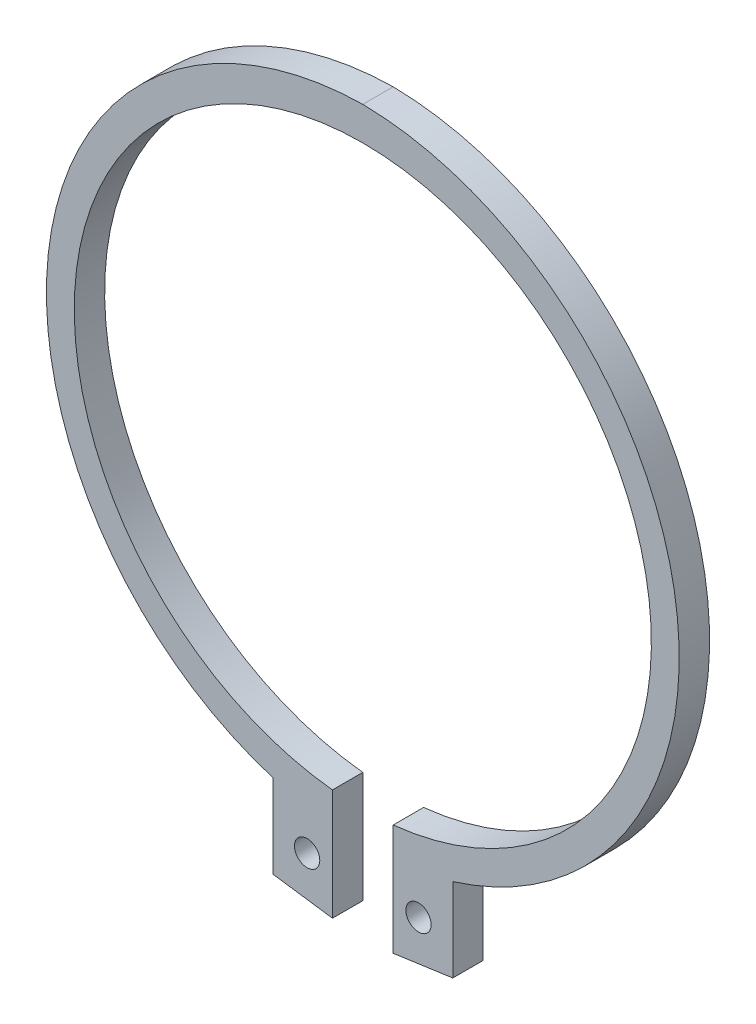
ISO-10303-21;
HEADER;
FILE_DESCRIPTION(('STEP AP214'),'2;1');
FILE_NAME('part.step','',(''),(''),'','','');
FILE_SCHEMA(('AUTOMOTIVE_DESIGN { 1 0 10303 214 1 1 1 1 }'));
ENDSEC;
DATA;
#1=APPLICATION_CONTEXT('core data for automotive mechanical design processes');
#2=APPLICATION_PROTOCOL_DEFINITION('international standard','automotive_design',2000,#1);
#3=PRODUCT_CONTEXT('',#1,'mechanical');
#4=PRODUCT('Part','Part','',(#3));
#5=PRODUCT_RELATED_PRODUCT_CATEGORY('part','',(#4));
#6=PRODUCT_DEFINITION_FORMATION('','',#4);
#7=PRODUCT_DEFINITION_CONTEXT('part definition',#1,'design');
#8=PRODUCT_DEFINITION('design','',#6,#7);
#9=PRODUCT_DEFINITION_SHAPE('','',#8);
#10=(LENGTH_UNIT() NAMED_UNIT(*) SI_UNIT(.MILLI.,.METRE.));
#11=(NAMED_UNIT(*) PLANE_ANGLE_UNIT() SI_UNIT($,.RADIAN.));
#12=(NAMED_UNIT(*) SI_UNIT($,.STERADIAN.) SOLID_ANGLE_UNIT());
#13=UNCERTAINTY_MEASURE_WITH_UNIT(LENGTH_MEASURE(1.E-05),#10,'distance_accuracy_value','');
#14=(GEOMETRIC_REPRESENTATION_CONTEXT(3) GLOBAL_UNCERTAINTY_ASSIGNED_CONTEXT((#13)) GLOBAL_UNIT_ASSIGNED_CONTEXT((#10,
#11,#12)) REPRESENTATION_CONTEXT('',''));
#15=CARTESIAN_POINT('',(0.,0.,0.));
#16=DIRECTION('',(0.,0.,1.));
#17=DIRECTION('',(1.,0.,0.));
#18=AXIS2_PLACEMENT_3D('',#15,#16,#17);
#19=CARTESIAN_POINT('',(5.5,-35.,1.5));
#20=DIRECTION('',(0.,0.,-1.));
#21=DIRECTION('',(1.,0.,0.));
#22=AXIS2_PLACEMENT_3D('',#19,#20,#21);
#23=CYLINDRICAL_SURFACE('',#22,1.25);
#24=CARTESIAN_POINT('',(5.5,-35.,0.));
#25=DIRECTION('',(0.,0.,1.));
#26=DIRECTION('',(1.,0.,0.));
#27=AXIS2_PLACEMENT_3D('',#24,#25,#26);
#28=CIRCLE('',#27,1.25);
#29=CARTESIAN_POINT('',(6.75,-35.,0.));
#30=VERTEX_POINT('',#29);
#31=EDGE_CURVE('E33',#30,#30,#28,.T.);
#32=ORIENTED_EDGE('',*,*,#31,.F.);
#33=EDGE_LOOP('',(#32));
#34=FACE_BOUND('',#33,.T.);
#35=CARTESIAN_POINT('',(5.5,-35.,3.));
#36=DIRECTION('',(0.,0.,-1.));
#37=DIRECTION('',(1.,0.,0.));
#38=AXIS2_PLACEMENT_3D('',#35,#36,#37);
#39=CIRCLE('',#38,1.25);
#40=CARTESIAN_POINT('',(6.75,-35.,3.));
#41=VERTEX_POINT('',#40);
#42=EDGE_CURVE('E131',#41,#41,#39,.T.);
#43=ORIENTED_EDGE('',*,*,#42,.F.);
#44=EDGE_LOOP('',(#43));
#45=FACE_BOUND('',#44,.T.);
#46=ADVANCED_FACE('F16',(#34,#45),#23,.F.);
#47=CARTESIAN_POINT('',(-5.5,-35.,1.5));
#48=DIRECTION('',(0.,0.,-1.));
#49=DIRECTION('',(1.,0.,0.));
#50=AXIS2_PLACEMENT_3D('',#47,#48,#49);
#51=CYLINDRICAL_SURFACE('',#50,1.25);
#52=CARTESIAN_POINT('',(-5.5,-35.,0.));
#53=DIRECTION('',(0.,0.,1.));
#54=DIRECTION('',(1.,0.,0.));
#55=AXIS2_PLACEMENT_3D('',#52,#53,#54);
#56=CIRCLE('',#55,1.25);
#57=CARTESIAN_POINT('',(-4.25,-35.,0.));
#58=VERTEX_POINT('',#57);
#59=EDGE_CURVE('E161',#58,#58,#56,.T.);
#60=ORIENTED_EDGE('',*,*,#59,.F.);
#61=EDGE_LOOP('',(#60));
#62=FACE_BOUND('',#61,.T.);
#63=CARTESIAN_POINT('',(-5.5,-35.,3.));
#64=DIRECTION('',(0.,0.,-1.));
#65=DIRECTION('',(1.,0.,0.));
#66=AXIS2_PLACEMENT_3D('',#63,#64,#65);
#67=CIRCLE('',#66,1.25);
#68=CARTESIAN_POINT('',(-4.25,-35.,3.));
#69=VERTEX_POINT('',#68);
#70=EDGE_CURVE('E137',#69,#69,#67,.T.);
#71=ORIENTED_EDGE('',*,*,#70,.F.);
#72=EDGE_LOOP('',(#71));
#73=FACE_BOUND('',#72,.T.);
#74=ADVANCED_FACE('F210',(#62,#73),#51,.F.);
#75=CARTESIAN_POINT('',(3.,-22.75,1.5));
#76=DIRECTION('',(-1.,0.,0.));
#77=DIRECTION('',(0.,0.,1.));
#78=AXIS2_PLACEMENT_3D('',#75,#76,#77);
#79=PLANE('',#78);
#80=DIRECTION('',(0.,0.,-1.));
#81=VECTOR('',#80,1.);
#82=CARTESIAN_POINT('',(3.,-39.3186793051128,2.25));
#83=LINE('',#82,#81);
#84=CARTESIAN_POINT('',(3.,-39.3186793051128,3.));
#85=VERTEX_POINT('',#84);
#86=CARTESIAN_POINT('',(3.,-39.3186793051128,0.));
#87=VERTEX_POINT('',#86);
#88=EDGE_CURVE('E11',#85,#87,#83,.T.);
#89=ORIENTED_EDGE('',*,*,#88,.F.);
#90=DIRECTION('',(0.,-1.,0.));
#91=VECTOR('',#90,1.);
#92=CARTESIAN_POINT('',(3.,-12.5343406785952,3.));
#93=LINE('',#92,#91);
#94=CARTESIAN_POINT('',(3.,-28.3416654415368,3.));
#95=VERTEX_POINT('',#94);
#96=EDGE_CURVE('E62',#95,#85,#93,.T.);
#97=ORIENTED_EDGE('',*,*,#96,.F.);
#98=DIRECTION('',(0.,0.,1.));
#99=VECTOR('',#98,1.);
#100=CARTESIAN_POINT('',(3.,-28.3416654415368,1.5));
#101=LINE('',#100,#99);
#102=CARTESIAN_POINT('',(3.,-28.3416654415368,0.));
#103=VERTEX_POINT('',#102);
#104=EDGE_CURVE('E67',#103,#95,#101,.T.);
#105=ORIENTED_EDGE('',*,*,#104,.F.);
#106=DIRECTION('',(0.,1.,0.));
#107=VECTOR('',#106,1.);
#108=CARTESIAN_POINT('',(3.,-12.5343406785952,0.));
#109=LINE('',#108,#107);
#110=EDGE_CURVE('E165',#87,#103,#109,.T.);
#111=ORIENTED_EDGE('',*,*,#110,.F.);
#112=EDGE_LOOP('',(#89,#97,#105,#111));
#113=FACE_BOUND('',#112,.T.);
#114=ADVANCED_FACE('F18',(#113),#79,.T.);
#115=CARTESIAN_POINT('',(-3.,-22.75,1.5));
#116=DIRECTION('',(1.,0.,0.));
#117=DIRECTION('',(0.,0.,-1.));
#118=AXIS2_PLACEMENT_3D('',#115,#116,#117);
#119=PLANE('',#118);
#120=DIRECTION('',(0.,0.,1.));
#121=VECTOR('',#120,1.);
#122=CARTESIAN_POINT('',(-3.,-39.3186793051128,0.75));
#123=LINE('',#122,#121);
#124=CARTESIAN_POINT('',(-3.,-39.3186793051128,0.));
#125=VERTEX_POINT('',#124);
#126=CARTESIAN_POINT('',(-3.,-39.3186793051128,3.));
#127=VERTEX_POINT('',#126);
#128=EDGE_CURVE('E150',#125,#127,#123,.T.);
#129=ORIENTED_EDGE('',*,*,#128,.F.);
#130=DIRECTION('',(0.,-1.,0.));
#131=VECTOR('',#130,1.);
#132=CARTESIAN_POINT('',(-3.,-12.5343406785952,0.));
#133=LINE('',#132,#131);
#134=CARTESIAN_POINT('',(-3.,-28.3416654415368,0.));
#135=VERTEX_POINT('',#134);
#136=EDGE_CURVE('E181',#135,#125,#133,.T.);
#137=ORIENTED_EDGE('',*,*,#136,.F.);
#138=DIRECTION('',(0.,0.,-1.));
#139=VECTOR('',#138,1.);
#140=CARTESIAN_POINT('',(-3.,-28.3416654415368,1.5));
#141=LINE('',#140,#139);
#142=CARTESIAN_POINT('',(-3.,-28.3416654415368,3.));
#143=VERTEX_POINT('',#142);
#144=EDGE_CURVE('E142',#143,#135,#141,.T.);
#145=ORIENTED_EDGE('',*,*,#144,.F.);
#146=DIRECTION('',(0.,1.,0.));
#147=VECTOR('',#146,1.);
#148=CARTESIAN_POINT('',(-3.,-12.5343406785952,3.));
#149=LINE('',#148,#147);
#150=EDGE_CURVE('E170',#127,#143,#149,.T.);
#151=ORIENTED_EDGE('',*,*,#150,.F.);
#152=EDGE_LOOP('',(#129,#137,#145,#151));
#153=FACE_BOUND('',#152,.T.);
#154=ADVANCED_FACE('F225',(#153),#119,.T.);
#155=CARTESIAN_POINT('',(5.68475265744546,-38.9395832273158,3.));
#156=DIRECTION('',(0.139816376114364,-0.990177449233342,0.));
#157=DIRECTION('',(-0.990177449233342,-0.139816376114364,0.));
#158=AXIS2_PLACEMENT_3D('',#155,#156,#157);
#159=PLANE('',#158);
#160=ORIENTED_EDGE('',*,*,#88,.T.);
#161=DIRECTION('',(0.990177449233342,0.139816376114364,0.));
#162=VECTOR('',#161,1.);
#163=CARTESIAN_POINT('',(8.88556664658266,-38.4876175590168,0.));
#164=LINE('',#163,#162);
#165=CARTESIAN_POINT('',(8.88556664658266,-38.4876175590168,0.));
#166=VERTEX_POINT('',#165);
#167=EDGE_CURVE('E26',#87,#166,#164,.T.);
#168=ORIENTED_EDGE('',*,*,#167,.T.);
#169=DIRECTION('',(0.,0.,-1.));
#170=VECTOR('',#169,1.);
#171=CARTESIAN_POINT('',(8.88556664658266,-38.4876175590168,3.));
#172=LINE('',#171,#170);
#173=CARTESIAN_POINT('',(8.88556664658266,-38.4876175590168,3.));
#174=VERTEX_POINT('',#173);
#175=EDGE_CURVE('E120',#174,#166,#172,.T.);
#176=ORIENTED_EDGE('',*,*,#175,.F.);
#177=DIRECTION('',(-0.990177449233342,-0.139816376114364,0.));
#178=VECTOR('',#177,1.);
#179=CARTESIAN_POINT('',(8.88556664658266,-38.4876175590168,3.));
#180=LINE('',#179,#178);
#181=EDGE_CURVE('E155',#174,#85,#180,.T.);
#182=ORIENTED_EDGE('',*,*,#181,.T.);
#183=EDGE_LOOP('',(#160,#168,#176,#182));
#184=FACE_BOUND('',#183,.T.);
#185=ADVANCED_FACE('F206',(#184),#159,.T.);
#186=CARTESIAN_POINT('',(-16.4490135772004,-2.31868135719037,0.));
#187=DIRECTION('',(0.,0.,1.));
#188=DIRECTION('',(1.,0.,0.));
#189=AXIS2_PLACEMENT_3D('',#186,#187,#188);
#190=PLANE('',#189);
#191=ORIENTED_EDGE('',*,*,#31,.T.);
#192=EDGE_LOOP('',(#191));
#193=FACE_BOUND('',#192,.T.);
#194=ORIENTED_EDGE('',*,*,#59,.T.);
#195=EDGE_LOOP('',(#194));
#196=FACE_BOUND('',#195,.T.);
#197=ORIENTED_EDGE('',*,*,#110,.T.);
#198=CARTESIAN_POINT('',(0.,0.,0.));
#199=DIRECTION('',(0.,0.,-1.));
#200=DIRECTION('',(-1.,0.,0.));
#201=AXIS2_PLACEMENT_3D('',#198,#199,#200);
#202=CIRCLE('',#201,28.5);
#203=EDGE_CURVE('E20',#135,#103,#202,.T.);
#204=ORIENTED_EDGE('',*,*,#203,.F.);
#205=ORIENTED_EDGE('',*,*,#136,.T.);
#206=DIRECTION('',(0.990177449233342,-0.139816376114364,0.));
#207=VECTOR('',#206,1.);
#208=CARTESIAN_POINT('',(-8.88556664658266,-38.4876175590168,0.));
#209=LINE('',#208,#207);
#210=CARTESIAN_POINT('',(-8.88556664658266,-38.4876175590168,0.));
#211=VERTEX_POINT('',#210);
#212=EDGE_CURVE('E126',#211,#125,#209,.T.);
#213=ORIENTED_EDGE('',*,*,#212,.F.);
#214=DIRECTION('',(0.,1.,0.));
#215=VECTOR('',#214,1.);
#216=CARTESIAN_POINT('',(-8.88556664658266,-38.4876175590168,0.));
#217=LINE('',#216,#215);
#218=CARTESIAN_POINT('',(-8.88556664658266,-30.2376175590168,0.));
#219=VERTEX_POINT('',#218);
#220=EDGE_CURVE('E180',#211,#219,#217,.T.);
#221=ORIENTED_EDGE('',*,*,#220,.T.);
#222=CARTESIAN_POINT('',(0.476948309335569,0.0765445073353296,0.));
#223=DIRECTION('',(0.,0.,1.));
#224=DIRECTION('',(1.,0.,0.));
#225=AXIS2_PLACEMENT_3D('',#222,#223,#224);
#226=CIRCLE('',#225,31.727040644927);
#227=CARTESIAN_POINT('',(0.,31.8,0.));
#228=VERTEX_POINT('',#227);
#229=EDGE_CURVE('E105',#228,#219,#226,.T.);
#230=ORIENTED_EDGE('',*,*,#229,.F.);
#231=CARTESIAN_POINT('',(-0.476948309335569,0.0765445073353296,0.));
#232=DIRECTION('',(0.,0.,1.));
#233=DIRECTION('',(-1.,0.,0.));
#234=AXIS2_PLACEMENT_3D('',#231,#232,#233);
#235=CIRCLE('',#234,31.727040644927);
#236=CARTESIAN_POINT('',(8.88556664658266,-30.2376175590168,0.));
#237=VERTEX_POINT('',#236);
#238=EDGE_CURVE('E174',#237,#228,#235,.T.);
#239=ORIENTED_EDGE('',*,*,#238,.F.);
#240=DIRECTION('',(0.,1.,0.));
#241=VECTOR('',#240,1.);
#242=CARTESIAN_POINT('',(8.88556664658266,-38.4876175590168,0.));
#243=LINE('',#242,#241);
#244=EDGE_CURVE('E154',#166,#237,#243,.T.);
#245=ORIENTED_EDGE('',*,*,#244,.F.);
#246=ORIENTED_EDGE('',*,*,#167,.F.);
#247=EDGE_LOOP('',(#197,#204,#205,#213,#221,#230,#239,#245,#246));
#248=FACE_BOUND('',#247,.T.);
#249=ADVANCED_FACE('F195',(#193,#196,#248),#190,.F.);
#250=CARTESIAN_POINT('',(-0.476948309335569,0.0765445073353296,3.));
#251=DIRECTION('',(0.,0.,1.));
#252=DIRECTION('',(-1.,0.,0.));
#253=AXIS2_PLACEMENT_3D('',#250,#251,#252);
#254=CYLINDRICAL_SURFACE('',#253,31.727040644927);
#255=ORIENTED_EDGE('',*,*,#238,.T.);
#256=DIRECTION('',(0.,0.,1.));
#257=VECTOR('',#256,1.);
#258=CARTESIAN_POINT('',(0.,31.8,0.));
#259=LINE('',#258,#257);
#260=CARTESIAN_POINT('',(0.,31.8,3.));
#261=VERTEX_POINT('',#260);
#262=EDGE_CURVE('E172',#228,#261,#259,.T.);
#263=ORIENTED_EDGE('',*,*,#262,.T.);
#264=CARTESIAN_POINT('',(-0.476948309335569,0.0765445073353296,3.));
#265=DIRECTION('',(0.,0.,-1.));
#266=DIRECTION('',(-1.,0.,0.));
#267=AXIS2_PLACEMENT_3D('',#264,#265,#266);
#268=CIRCLE('',#267,31.727040644927);
#269=CARTESIAN_POINT('',(8.88556664658266,-30.2376175590168,3.));
#270=VERTEX_POINT('',#269);
#271=EDGE_CURVE('E118',#261,#270,#268,.T.);
#272=ORIENTED_EDGE('',*,*,#271,.T.);
#273=DIRECTION('',(0.,0.,-1.));
#274=VECTOR('',#273,1.);
#275=CARTESIAN_POINT('',(8.88556664658266,-30.2376175590168,3.));
#276=LINE('',#275,#274);
#277=EDGE_CURVE('E177',#270,#237,#276,.T.);
#278=ORIENTED_EDGE('',*,*,#277,.T.);
#279=EDGE_LOOP('',(#255,#263,#272,#278));
#280=FACE_BOUND('',#279,.T.);
#281=ADVANCED_FACE('F197',(#280),#254,.T.);
#282=CARTESIAN_POINT('',(8.88556664658266,-34.3626175590168,3.));
#283=DIRECTION('',(1.,0.,0.));
#284=DIRECTION('',(0.,-1.,0.));
#285=AXIS2_PLACEMENT_3D('',#282,#283,#284);
#286=PLANE('',#285);
#287=ORIENTED_EDGE('',*,*,#244,.T.);
#288=ORIENTED_EDGE('',*,*,#277,.F.);
#289=DIRECTION('',(0.,1.,0.));
#290=VECTOR('',#289,1.);
#291=CARTESIAN_POINT('',(8.88556664658266,-38.4876175590168,3.));
#292=LINE('',#291,#290);
#293=EDGE_CURVE('E141',#174,#270,#292,.T.);
#294=ORIENTED_EDGE('',*,*,#293,.F.);
#295=ORIENTED_EDGE('',*,*,#175,.T.);
#296=EDGE_LOOP('',(#287,#288,#294,#295));
#297=FACE_BOUND('',#296,.T.);
#298=ADVANCED_FACE('F192',(#297),#286,.T.);
#299=CARTESIAN_POINT('',(0.476948309335569,0.0765445073353296,0.));
#300=DIRECTION('',(0.,0.,-1.));
#301=DIRECTION('',(1.,0.,0.));
#302=AXIS2_PLACEMENT_3D('',#299,#300,#301);
#303=CYLINDRICAL_SURFACE('',#302,31.727040644927);
#304=CARTESIAN_POINT('',(0.476948309335569,0.0765445073353296,3.));
#305=DIRECTION('',(0.,0.,-1.));
#306=DIRECTION('',(1.,0.,0.));
#307=AXIS2_PLACEMENT_3D('',#304,#305,#306);
#308=CIRCLE('',#307,31.727040644927);
#309=CARTESIAN_POINT('',(-8.88556664658266,-30.2376175590168,3.));
#310=VERTEX_POINT('',#309);
#311=EDGE_CURVE('E104',#310,#261,#308,.T.);
#312=ORIENTED_EDGE('',*,*,#311,.T.);
#313=ORIENTED_EDGE('',*,*,#262,.F.);
#314=ORIENTED_EDGE('',*,*,#229,.T.);
#315=DIRECTION('',(0.,0.,1.));
#316=VECTOR('',#315,1.);
#317=CARTESIAN_POINT('',(-8.88556664658266,-30.2376175590168,0.));
#318=LINE('',#317,#316);
#319=EDGE_CURVE('E100',#219,#310,#318,.T.);
#320=ORIENTED_EDGE('',*,*,#319,.T.);
#321=EDGE_LOOP('',(#312,#313,#314,#320));
#322=FACE_BOUND('',#321,.T.);
#323=ADVANCED_FACE('F102',(#322),#303,.T.);
#324=CARTESIAN_POINT('',(0.,0.,0.));
#325=DIRECTION('',(0.,0.,-1.));
#326=DIRECTION('',(1.,0.,0.));
#327=AXIS2_PLACEMENT_3D('',#324,#325,#326);
#328=CYLINDRICAL_SURFACE('',#327,28.5);
#329=ORIENTED_EDGE('',*,*,#104,.T.);
#330=CARTESIAN_POINT('',(0.,0.,3.));
#331=DIRECTION('',(0.,0.,-1.));
#332=DIRECTION('',(-1.,0.,0.));
#333=AXIS2_PLACEMENT_3D('',#330,#331,#332);
#334=CIRCLE('',#333,28.5);
#335=EDGE_CURVE('E169',#143,#95,#334,.T.);
#336=ORIENTED_EDGE('',*,*,#335,.F.);
#337=ORIENTED_EDGE('',*,*,#144,.T.);
#338=ORIENTED_EDGE('',*,*,#203,.T.);
#339=EDGE_LOOP('',(#329,#336,#337,#338));
#340=FACE_BOUND('',#339,.T.);
#341=ADVANCED_FACE('F222',(#340),#328,.F.);
#342=CARTESIAN_POINT('',(-5.68475265744546,-38.9395832273158,0.));
#343=DIRECTION('',(-0.139816376114364,-0.990177449233342,0.));
#344=DIRECTION('',(0.990177449233342,-0.139816376114364,0.));
#345=AXIS2_PLACEMENT_3D('',#342,#343,#344);
#346=PLANE('',#345);
#347=ORIENTED_EDGE('',*,*,#128,.T.);
#348=DIRECTION('',(-0.990177449233342,0.139816376114364,0.));
#349=VECTOR('',#348,1.);
#350=CARTESIAN_POINT('',(-8.88556664658266,-38.4876175590168,3.));
#351=LINE('',#350,#349);
#352=CARTESIAN_POINT('',(-8.88556664658266,-38.4876175590168,3.));
#353=VERTEX_POINT('',#352);
#354=EDGE_CURVE('E129',#127,#353,#351,.T.);
#355=ORIENTED_EDGE('',*,*,#354,.T.);
#356=DIRECTION('',(0.,0.,1.));
#357=VECTOR('',#356,1.);
#358=CARTESIAN_POINT('',(-8.88556664658266,-38.4876175590168,0.));
#359=LINE('',#358,#357);
#360=EDGE_CURVE('E124',#211,#353,#359,.T.);
#361=ORIENTED_EDGE('',*,*,#360,.F.);
#362=ORIENTED_EDGE('',*,*,#212,.T.);
#363=EDGE_LOOP('',(#347,#355,#361,#362));
#364=FACE_BOUND('',#363,.T.);
#365=ADVANCED_FACE('F218',(#364),#346,.T.);
#366=CARTESIAN_POINT('',(-8.88556664658266,-34.3626175590168,0.));
#367=DIRECTION('',(-1.,0.,0.));
#368=DIRECTION('',(0.,-1.,0.));
#369=AXIS2_PLACEMENT_3D('',#366,#367,#368);
#370=PLANE('',#369);
#371=DIRECTION('',(0.,1.,0.));
#372=VECTOR('',#371,1.);
#373=CARTESIAN_POINT('',(-8.88556664658266,-38.4876175590168,3.));
#374=LINE('',#373,#372);
#375=EDGE_CURVE('E115',#353,#310,#374,.T.);
#376=ORIENTED_EDGE('',*,*,#375,.T.);
#377=ORIENTED_EDGE('',*,*,#319,.F.);
#378=ORIENTED_EDGE('',*,*,#220,.F.);
#379=ORIENTED_EDGE('',*,*,#360,.T.);
#380=EDGE_LOOP('',(#376,#377,#378,#379));
#381=FACE_BOUND('',#380,.T.);
#382=ADVANCED_FACE('F122',(#381),#370,.T.);
#383=CARTESIAN_POINT('',(-16.4490135772004,-2.31868135719037,3.));
#384=DIRECTION('',(0.,0.,1.));
#385=DIRECTION('',(1.,0.,0.));
#386=AXIS2_PLACEMENT_3D('',#383,#384,#385);
#387=PLANE('',#386);
#388=ORIENTED_EDGE('',*,*,#42,.T.);
#389=EDGE_LOOP('',(#388));
#390=FACE_BOUND('',#389,.T.);
#391=ORIENTED_EDGE('',*,*,#70,.T.);
#392=EDGE_LOOP('',(#391));
#393=FACE_BOUND('',#392,.T.);
#394=ORIENTED_EDGE('',*,*,#96,.T.);
#395=ORIENTED_EDGE('',*,*,#181,.F.);
#396=ORIENTED_EDGE('',*,*,#293,.T.);
#397=ORIENTED_EDGE('',*,*,#271,.F.);
#398=ORIENTED_EDGE('',*,*,#311,.F.);
#399=ORIENTED_EDGE('',*,*,#375,.F.);
#400=ORIENTED_EDGE('',*,*,#354,.F.);
#401=ORIENTED_EDGE('',*,*,#150,.T.);
#402=ORIENTED_EDGE('',*,*,#335,.T.);
#403=EDGE_LOOP('',(#394,#395,#396,#397,#398,#399,#400,#401,#402));
#404=FACE_BOUND('',#403,.T.);
#405=ADVANCED_FACE('F113',(#390,#393,#404),#387,.T.);
#406=CLOSED_SHELL('',(#46,#74,#114,#154,#185,#249,#281,#298,#323,#341,#365,#382,#405));
#407=MANIFOLD_SOLID_BREP('B1',#406);
#408=ADVANCED_BREP_SHAPE_REPRESENTATION('',(#18,#407),#14);
#409=SHAPE_DEFINITION_REPRESENTATION(#9,#408);
ENDSEC;
END-ISO-10303-21;
